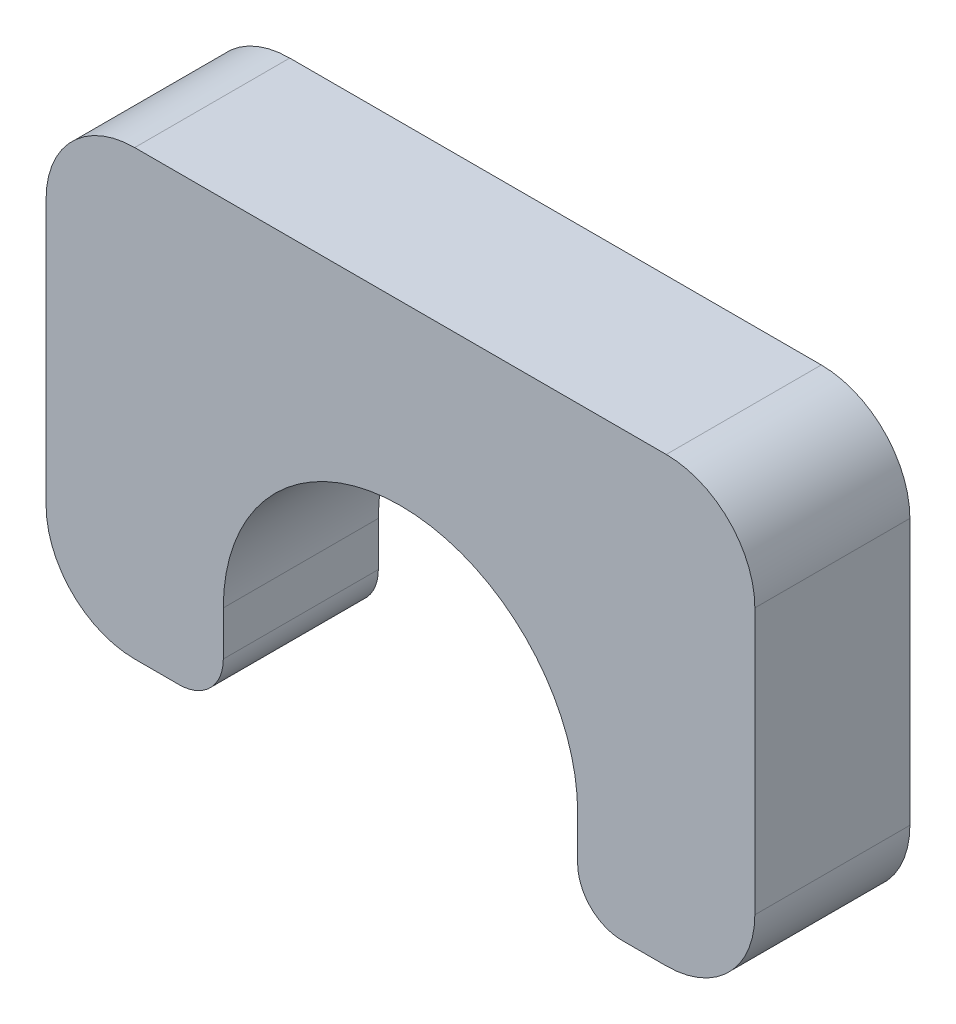
ISO-10303-21;
HEADER;
FILE_DESCRIPTION(('STEP AP214'),'2;1');
FILE_NAME('part.step','',(''),(''),'','','');
FILE_SCHEMA(('AUTOMOTIVE_DESIGN { 1 0 10303 214 1 1 1 1 }'));
ENDSEC;
DATA;
#1=APPLICATION_CONTEXT('core data for automotive mechanical design processes');
#2=APPLICATION_PROTOCOL_DEFINITION('international standard','automotive_design',2000,#1);
#3=PRODUCT_CONTEXT('',#1,'mechanical');
#4=PRODUCT('Part','Part','',(#3));
#5=PRODUCT_RELATED_PRODUCT_CATEGORY('part','',(#4));
#6=PRODUCT_DEFINITION_FORMATION('','',#4);
#7=PRODUCT_DEFINITION_CONTEXT('part definition',#1,'design');
#8=PRODUCT_DEFINITION('design','',#6,#7);
#9=PRODUCT_DEFINITION_SHAPE('','',#8);
#10=(LENGTH_UNIT() NAMED_UNIT(*) SI_UNIT(.MILLI.,.METRE.));
#11=(NAMED_UNIT(*) PLANE_ANGLE_UNIT() SI_UNIT($,.RADIAN.));
#12=(NAMED_UNIT(*) SI_UNIT($,.STERADIAN.) SOLID_ANGLE_UNIT());
#13=UNCERTAINTY_MEASURE_WITH_UNIT(LENGTH_MEASURE(1.E-05),#10,'distance_accuracy_value','');
#14=(GEOMETRIC_REPRESENTATION_CONTEXT(3) GLOBAL_UNCERTAINTY_ASSIGNED_CONTEXT((#13)) GLOBAL_UNIT_ASSIGNED_CONTEXT((#10,
#11,#12)) REPRESENTATION_CONTEXT('',''));
#15=CARTESIAN_POINT('',(0.,0.,0.));
#16=DIRECTION('',(0.,0.,1.));
#17=DIRECTION('',(1.,0.,0.));
#18=AXIS2_PLACEMENT_3D('',#15,#16,#17);
#19=CARTESIAN_POINT('',(-4.,0.,3.5));
#20=DIRECTION('',(-1.,0.,0.));
#21=DIRECTION('',(0.,0.,1.));
#22=AXIS2_PLACEMENT_3D('',#19,#20,#21);
#23=PLANE('',#22);
#24=DIRECTION('',(0.,1.,0.));
#25=VECTOR('',#24,1.);
#26=CARTESIAN_POINT('',(-4.,0.,3.5));
#27=LINE('',#26,#25);
#28=CARTESIAN_POINT('',(-4.,-4.,3.5));
#29=VERTEX_POINT('',#28);
#30=CARTESIAN_POINT('',(-4.,-3.,3.5));
#31=VERTEX_POINT('',#30);
#32=EDGE_CURVE('E141',#29,#31,#27,.T.);
#33=ORIENTED_EDGE('',*,*,#32,.F.);
#34=DIRECTION('',(0.,0.,-1.));
#35=VECTOR('',#34,1.);
#36=CARTESIAN_POINT('',(-4.,-4.,3.5));
#37=LINE('',#36,#35);
#38=CARTESIAN_POINT('',(-4.,-4.,0.));
#39=VERTEX_POINT('',#38);
#40=EDGE_CURVE('E50',#29,#39,#37,.T.);
#41=ORIENTED_EDGE('',*,*,#40,.T.);
#42=DIRECTION('',(0.,1.,0.));
#43=VECTOR('',#42,1.);
#44=CARTESIAN_POINT('',(-4.,0.,0.));
#45=LINE('',#44,#43);
#46=CARTESIAN_POINT('',(-4.,-3.,0.));
#47=VERTEX_POINT('',#46);
#48=EDGE_CURVE('E165',#39,#47,#45,.T.);
#49=ORIENTED_EDGE('',*,*,#48,.T.);
#50=DIRECTION('',(0.,0.,-1.));
#51=VECTOR('',#50,1.);
#52=CARTESIAN_POINT('',(-4.,-3.,3.5));
#53=LINE('',#52,#51);
#54=EDGE_CURVE('E158',#31,#47,#53,.T.);
#55=ORIENTED_EDGE('',*,*,#54,.F.);
#56=EDGE_LOOP('',(#33,#41,#49,#55));
#57=FACE_BOUND('',#56,.T.);
#58=ADVANCED_FACE('F41',(#57),#23,.F.);
#59=CARTESIAN_POINT('',(0.,-3.,3.5));
#60=DIRECTION('',(0.,0.,-1.));
#61=DIRECTION('',(-1.,0.,0.));
#62=AXIS2_PLACEMENT_3D('',#59,#60,#61);
#63=CYLINDRICAL_SURFACE('',#62,4.);
#64=CARTESIAN_POINT('',(0.,-3.,0.));
#65=DIRECTION('',(0.,0.,1.));
#66=DIRECTION('',(1.,0.,0.));
#67=AXIS2_PLACEMENT_3D('',#64,#65,#66);
#68=CIRCLE('',#67,4.);
#69=CARTESIAN_POINT('',(4.,-3.,0.));
#70=VERTEX_POINT('',#69);
#71=EDGE_CURVE('E197',#47,#70,#68,.F.);
#72=ORIENTED_EDGE('',*,*,#71,.T.);
#73=DIRECTION('',(0.,0.,-1.));
#74=VECTOR('',#73,1.);
#75=CARTESIAN_POINT('',(4.,-3.,3.5));
#76=LINE('',#75,#74);
#77=CARTESIAN_POINT('',(4.,-3.,3.5));
#78=VERTEX_POINT('',#77);
#79=EDGE_CURVE('E160',#78,#70,#76,.T.);
#80=ORIENTED_EDGE('',*,*,#79,.F.);
#81=CARTESIAN_POINT('',(0.,-3.,3.5));
#82=DIRECTION('',(0.,0.,1.));
#83=DIRECTION('',(1.,0.,0.));
#84=AXIS2_PLACEMENT_3D('',#81,#82,#83);
#85=CIRCLE('',#84,4.);
#86=EDGE_CURVE('E145',#31,#78,#85,.F.);
#87=ORIENTED_EDGE('',*,*,#86,.F.);
#88=ORIENTED_EDGE('',*,*,#54,.T.);
#89=EDGE_LOOP('',(#72,#80,#87,#88));
#90=FACE_BOUND('',#89,.T.);
#91=ADVANCED_FACE('F157',(#90),#63,.F.);
#92=CARTESIAN_POINT('',(4.,0.,3.5));
#93=DIRECTION('',(-1.,0.,0.));
#94=DIRECTION('',(0.,0.,1.));
#95=AXIS2_PLACEMENT_3D('',#92,#93,#94);
#96=PLANE('',#95);
#97=DIRECTION('',(0.,1.,0.));
#98=VECTOR('',#97,1.);
#99=CARTESIAN_POINT('',(4.,0.,0.));
#100=LINE('',#99,#98);
#101=CARTESIAN_POINT('',(4.,-4.,0.));
#102=VERTEX_POINT('',#101);
#103=EDGE_CURVE('E201',#102,#70,#100,.T.);
#104=ORIENTED_EDGE('',*,*,#103,.F.);
#105=DIRECTION('',(0.,0.,-1.));
#106=VECTOR('',#105,1.);
#107=CARTESIAN_POINT('',(4.,-4.,3.5));
#108=LINE('',#107,#106);
#109=CARTESIAN_POINT('',(4.,-4.,3.5));
#110=VERTEX_POINT('',#109);
#111=EDGE_CURVE('E184',#102,#110,#108,.F.);
#112=ORIENTED_EDGE('',*,*,#111,.T.);
#113=DIRECTION('',(0.,1.,0.));
#114=VECTOR('',#113,1.);
#115=CARTESIAN_POINT('',(4.,0.,3.5));
#116=LINE('',#115,#114);
#117=EDGE_CURVE('E162',#110,#78,#116,.T.);
#118=ORIENTED_EDGE('',*,*,#117,.T.);
#119=ORIENTED_EDGE('',*,*,#79,.T.);
#120=EDGE_LOOP('',(#104,#112,#118,#119));
#121=FACE_BOUND('',#120,.T.);
#122=ADVANCED_FACE('F313',(#121),#96,.T.);
#123=CARTESIAN_POINT('',(0.,-5.,3.5));
#124=DIRECTION('',(0.,1.,0.));
#125=DIRECTION('',(0.,0.,1.));
#126=AXIS2_PLACEMENT_3D('',#123,#124,#125);
#127=PLANE('',#126);
#128=DIRECTION('',(1.,0.,0.));
#129=VECTOR('',#128,1.);
#130=CARTESIAN_POINT('',(0.,-5.,3.5));
#131=LINE('',#130,#129);
#132=CARTESIAN_POINT('',(5.,-5.,3.5));
#133=VERTEX_POINT('',#132);
#134=CARTESIAN_POINT('',(6.,-5.,3.5));
#135=VERTEX_POINT('',#134);
#136=EDGE_CURVE('E288',#133,#135,#131,.T.);
#137=ORIENTED_EDGE('',*,*,#136,.F.);
#138=DIRECTION('',(0.,0.,-1.));
#139=VECTOR('',#138,1.);
#140=CARTESIAN_POINT('',(5.,-5.,0.));
#141=LINE('',#140,#139);
#142=CARTESIAN_POINT('',(5.,-5.,0.));
#143=VERTEX_POINT('',#142);
#144=EDGE_CURVE('E168',#133,#143,#141,.T.);
#145=ORIENTED_EDGE('',*,*,#144,.T.);
#146=DIRECTION('',(1.,0.,0.));
#147=VECTOR('',#146,1.);
#148=CARTESIAN_POINT('',(0.,-5.,0.));
#149=LINE('',#148,#147);
#150=CARTESIAN_POINT('',(6.,-5.,0.));
#151=VERTEX_POINT('',#150);
#152=EDGE_CURVE('E209',#143,#151,#149,.T.);
#153=ORIENTED_EDGE('',*,*,#152,.T.);
#154=DIRECTION('',(0.,0.,-1.));
#155=VECTOR('',#154,1.);
#156=CARTESIAN_POINT('',(6.,-5.,3.5));
#157=LINE('',#156,#155);
#158=EDGE_CURVE('E175',#135,#151,#157,.T.);
#159=ORIENTED_EDGE('',*,*,#158,.F.);
#160=EDGE_LOOP('',(#137,#145,#153,#159));
#161=FACE_BOUND('',#160,.T.);
#162=ADVANCED_FACE('F319',(#161),#127,.F.);
#163=CARTESIAN_POINT('',(6.,-3.,3.5));
#164=DIRECTION('',(0.,0.,-1.));
#165=DIRECTION('',(-1.,0.,0.));
#166=AXIS2_PLACEMENT_3D('',#163,#164,#165);
#167=CYLINDRICAL_SURFACE('',#166,2.);
#168=CARTESIAN_POINT('',(6.,-3.,0.));
#169=DIRECTION('',(0.,0.,1.));
#170=DIRECTION('',(1.,0.,0.));
#171=AXIS2_PLACEMENT_3D('',#168,#169,#170);
#172=CIRCLE('',#171,2.);
#173=CARTESIAN_POINT('',(8.,-3.,0.));
#174=VERTEX_POINT('',#173);
#175=EDGE_CURVE('E212',#151,#174,#172,.T.);
#176=ORIENTED_EDGE('',*,*,#175,.T.);
#177=DIRECTION('',(0.,0.,-1.));
#178=VECTOR('',#177,1.);
#179=CARTESIAN_POINT('',(8.,-3.,3.5));
#180=LINE('',#179,#178);
#181=CARTESIAN_POINT('',(8.,-3.,3.5));
#182=VERTEX_POINT('',#181);
#183=EDGE_CURVE('E258',#182,#174,#180,.T.);
#184=ORIENTED_EDGE('',*,*,#183,.F.);
#185=CARTESIAN_POINT('',(6.,-3.,3.5));
#186=DIRECTION('',(0.,0.,1.));
#187=DIRECTION('',(1.,0.,0.));
#188=AXIS2_PLACEMENT_3D('',#185,#186,#187);
#189=CIRCLE('',#188,2.);
#190=EDGE_CURVE('E269',#135,#182,#189,.T.);
#191=ORIENTED_EDGE('',*,*,#190,.F.);
#192=ORIENTED_EDGE('',*,*,#158,.T.);
#193=EDGE_LOOP('',(#176,#184,#191,#192));
#194=FACE_BOUND('',#193,.T.);
#195=ADVANCED_FACE('F267',(#194),#167,.T.);
#196=CARTESIAN_POINT('',(8.,0.,3.5));
#197=DIRECTION('',(-1.,0.,0.));
#198=DIRECTION('',(0.,0.,1.));
#199=AXIS2_PLACEMENT_3D('',#196,#197,#198);
#200=PLANE('',#199);
#201=DIRECTION('',(0.,1.,0.));
#202=VECTOR('',#201,1.);
#203=CARTESIAN_POINT('',(8.,0.,0.));
#204=LINE('',#203,#202);
#205=CARTESIAN_POINT('',(8.,3.,0.));
#206=VERTEX_POINT('',#205);
#207=EDGE_CURVE('E215',#174,#206,#204,.T.);
#208=ORIENTED_EDGE('',*,*,#207,.T.);
#209=DIRECTION('',(0.,0.,-1.));
#210=VECTOR('',#209,1.);
#211=CARTESIAN_POINT('',(8.,3.,3.5));
#212=LINE('',#211,#210);
#213=CARTESIAN_POINT('',(8.,3.,3.5));
#214=VERTEX_POINT('',#213);
#215=EDGE_CURVE('E255',#214,#206,#212,.T.);
#216=ORIENTED_EDGE('',*,*,#215,.F.);
#217=DIRECTION('',(0.,1.,0.));
#218=VECTOR('',#217,1.);
#219=CARTESIAN_POINT('',(8.,0.,3.5));
#220=LINE('',#219,#218);
#221=EDGE_CURVE('E279',#182,#214,#220,.T.);
#222=ORIENTED_EDGE('',*,*,#221,.F.);
#223=ORIENTED_EDGE('',*,*,#183,.T.);
#224=EDGE_LOOP('',(#208,#216,#222,#223));
#225=FACE_BOUND('',#224,.T.);
#226=ADVANCED_FACE('F276',(#225),#200,.F.);
#227=CARTESIAN_POINT('',(6.,3.,3.5));
#228=DIRECTION('',(0.,0.,-1.));
#229=DIRECTION('',(-1.,0.,0.));
#230=AXIS2_PLACEMENT_3D('',#227,#228,#229);
#231=CYLINDRICAL_SURFACE('',#230,2.);
#232=CARTESIAN_POINT('',(6.,3.,0.));
#233=DIRECTION('',(0.,0.,1.));
#234=DIRECTION('',(1.,0.,0.));
#235=AXIS2_PLACEMENT_3D('',#232,#233,#234);
#236=CIRCLE('',#235,2.);
#237=CARTESIAN_POINT('',(6.,5.,0.));
#238=VERTEX_POINT('',#237);
#239=EDGE_CURVE('E219',#238,#206,#236,.F.);
#240=ORIENTED_EDGE('',*,*,#239,.F.);
#241=DIRECTION('',(0.,0.,-1.));
#242=VECTOR('',#241,1.);
#243=CARTESIAN_POINT('',(6.,5.,3.5));
#244=LINE('',#243,#242);
#245=CARTESIAN_POINT('',(6.,5.,3.5));
#246=VERTEX_POINT('',#245);
#247=EDGE_CURVE('E252',#246,#238,#244,.T.);
#248=ORIENTED_EDGE('',*,*,#247,.F.);
#249=CARTESIAN_POINT('',(6.,3.,3.5));
#250=DIRECTION('',(0.,0.,1.));
#251=DIRECTION('',(1.,0.,0.));
#252=AXIS2_PLACEMENT_3D('',#249,#250,#251);
#253=CIRCLE('',#252,2.);
#254=EDGE_CURVE('E282',#246,#214,#253,.F.);
#255=ORIENTED_EDGE('',*,*,#254,.T.);
#256=ORIENTED_EDGE('',*,*,#215,.T.);
#257=EDGE_LOOP('',(#240,#248,#255,#256));
#258=FACE_BOUND('',#257,.T.);
#259=ADVANCED_FACE('F381',(#258),#231,.T.);
#260=CARTESIAN_POINT('',(0.,5.,3.5));
#261=DIRECTION('',(0.,1.,0.));
#262=DIRECTION('',(0.,0.,1.));
#263=AXIS2_PLACEMENT_3D('',#260,#261,#262);
#264=PLANE('',#263);
#265=DIRECTION('',(1.,0.,0.));
#266=VECTOR('',#265,1.);
#267=CARTESIAN_POINT('',(0.,5.,0.));
#268=LINE('',#267,#266);
#269=CARTESIAN_POINT('',(-6.,5.,0.));
#270=VERTEX_POINT('',#269);
#271=EDGE_CURVE('E223',#270,#238,#268,.T.);
#272=ORIENTED_EDGE('',*,*,#271,.F.);
#273=DIRECTION('',(0.,0.,-1.));
#274=VECTOR('',#273,1.);
#275=CARTESIAN_POINT('',(-6.,5.,3.5));
#276=LINE('',#275,#274);
#277=CARTESIAN_POINT('',(-6.,5.,3.5));
#278=VERTEX_POINT('',#277);
#279=EDGE_CURVE('E249',#278,#270,#276,.T.);
#280=ORIENTED_EDGE('',*,*,#279,.F.);
#281=DIRECTION('',(1.,0.,0.));
#282=VECTOR('',#281,1.);
#283=CARTESIAN_POINT('',(0.,5.,3.5));
#284=LINE('',#283,#282);
#285=EDGE_CURVE('E286',#278,#246,#284,.T.);
#286=ORIENTED_EDGE('',*,*,#285,.T.);
#287=ORIENTED_EDGE('',*,*,#247,.T.);
#288=EDGE_LOOP('',(#272,#280,#286,#287));
#289=FACE_BOUND('',#288,.T.);
#290=ADVANCED_FACE('F373',(#289),#264,.T.);
#291=CARTESIAN_POINT('',(-6.,3.,3.5));
#292=DIRECTION('',(0.,0.,-1.));
#293=DIRECTION('',(-1.,0.,0.));
#294=AXIS2_PLACEMENT_3D('',#291,#292,#293);
#295=CYLINDRICAL_SURFACE('',#294,2.);
#296=CARTESIAN_POINT('',(-6.,3.,0.));
#297=DIRECTION('',(0.,0.,1.));
#298=DIRECTION('',(1.,0.,0.));
#299=AXIS2_PLACEMENT_3D('',#296,#297,#298);
#300=CIRCLE('',#299,2.);
#301=CARTESIAN_POINT('',(-8.,3.,0.));
#302=VERTEX_POINT('',#301);
#303=EDGE_CURVE('E227',#302,#270,#300,.F.);
#304=ORIENTED_EDGE('',*,*,#303,.F.);
#305=DIRECTION('',(0.,0.,-1.));
#306=VECTOR('',#305,1.);
#307=CARTESIAN_POINT('',(-8.,3.,3.5));
#308=LINE('',#307,#306);
#309=CARTESIAN_POINT('',(-8.,3.,3.5));
#310=VERTEX_POINT('',#309);
#311=EDGE_CURVE('E246',#310,#302,#308,.T.);
#312=ORIENTED_EDGE('',*,*,#311,.F.);
#313=CARTESIAN_POINT('',(-6.,3.,3.5));
#314=DIRECTION('',(0.,0.,1.));
#315=DIRECTION('',(1.,0.,0.));
#316=AXIS2_PLACEMENT_3D('',#313,#314,#315);
#317=CIRCLE('',#316,2.);
#318=EDGE_CURVE('E295',#310,#278,#317,.F.);
#319=ORIENTED_EDGE('',*,*,#318,.T.);
#320=ORIENTED_EDGE('',*,*,#279,.T.);
#321=EDGE_LOOP('',(#304,#312,#319,#320));
#322=FACE_BOUND('',#321,.T.);
#323=ADVANCED_FACE('F366',(#322),#295,.T.);
#324=CARTESIAN_POINT('',(-8.,0.,3.5));
#325=DIRECTION('',(-1.,0.,0.));
#326=DIRECTION('',(0.,0.,1.));
#327=AXIS2_PLACEMENT_3D('',#324,#325,#326);
#328=PLANE('',#327);
#329=DIRECTION('',(0.,1.,0.));
#330=VECTOR('',#329,1.);
#331=CARTESIAN_POINT('',(-8.,0.,0.));
#332=LINE('',#331,#330);
#333=CARTESIAN_POINT('',(-8.,-3.,0.));
#334=VERTEX_POINT('',#333);
#335=EDGE_CURVE('E231',#334,#302,#332,.T.);
#336=ORIENTED_EDGE('',*,*,#335,.F.);
#337=DIRECTION('',(0.,0.,-1.));
#338=VECTOR('',#337,1.);
#339=CARTESIAN_POINT('',(-8.,-3.,3.5));
#340=LINE('',#339,#338);
#341=CARTESIAN_POINT('',(-8.,-3.,3.5));
#342=VERTEX_POINT('',#341);
#343=EDGE_CURVE('E242',#342,#334,#340,.T.);
#344=ORIENTED_EDGE('',*,*,#343,.F.);
#345=DIRECTION('',(0.,1.,0.));
#346=VECTOR('',#345,1.);
#347=CARTESIAN_POINT('',(-8.,0.,3.5));
#348=LINE('',#347,#346);
#349=EDGE_CURVE('E298',#342,#310,#348,.T.);
#350=ORIENTED_EDGE('',*,*,#349,.T.);
#351=ORIENTED_EDGE('',*,*,#311,.T.);
#352=EDGE_LOOP('',(#336,#344,#350,#351));
#353=FACE_BOUND('',#352,.T.);
#354=ADVANCED_FACE('F360',(#353),#328,.T.);
#355=CARTESIAN_POINT('',(-6.,-3.,3.5));
#356=DIRECTION('',(0.,0.,-1.));
#357=DIRECTION('',(-1.,0.,0.));
#358=AXIS2_PLACEMENT_3D('',#355,#356,#357);
#359=CYLINDRICAL_SURFACE('',#358,2.);
#360=CARTESIAN_POINT('',(-6.,-3.,0.));
#361=DIRECTION('',(0.,0.,1.));
#362=DIRECTION('',(1.,0.,0.));
#363=AXIS2_PLACEMENT_3D('',#360,#361,#362);
#364=CIRCLE('',#363,2.);
#365=CARTESIAN_POINT('',(-6.,-5.,0.));
#366=VERTEX_POINT('',#365);
#367=EDGE_CURVE('E235',#366,#334,#364,.F.);
#368=ORIENTED_EDGE('',*,*,#367,.F.);
#369=DIRECTION('',(0.,0.,-1.));
#370=VECTOR('',#369,1.);
#371=CARTESIAN_POINT('',(-6.,-5.,3.5));
#372=LINE('',#371,#370);
#373=CARTESIAN_POINT('',(-6.,-5.,3.5));
#374=VERTEX_POINT('',#373);
#375=EDGE_CURVE('E239',#374,#366,#372,.T.);
#376=ORIENTED_EDGE('',*,*,#375,.F.);
#377=CARTESIAN_POINT('',(-6.,-3.,3.5));
#378=DIRECTION('',(0.,0.,1.));
#379=DIRECTION('',(1.,0.,0.));
#380=AXIS2_PLACEMENT_3D('',#377,#378,#379);
#381=CIRCLE('',#380,2.);
#382=EDGE_CURVE('E204',#374,#342,#381,.F.);
#383=ORIENTED_EDGE('',*,*,#382,.T.);
#384=ORIENTED_EDGE('',*,*,#343,.T.);
#385=EDGE_LOOP('',(#368,#376,#383,#384));
#386=FACE_BOUND('',#385,.T.);
#387=ADVANCED_FACE('F332',(#386),#359,.T.);
#388=CARTESIAN_POINT('',(-5.,-5.,0.));
#389=VERTEX_POINT('',#388);
#390=EDGE_CURVE('E152',#366,#389,#149,.T.);
#391=ORIENTED_EDGE('',*,*,#390,.T.);
#392=DIRECTION('',(0.,0.,-1.));
#393=VECTOR('',#392,1.);
#394=CARTESIAN_POINT('',(-5.,-5.,3.5));
#395=LINE('',#394,#393);
#396=CARTESIAN_POINT('',(-5.,-5.,3.5));
#397=VERTEX_POINT('',#396);
#398=EDGE_CURVE('E11',#389,#397,#395,.F.);
#399=ORIENTED_EDGE('',*,*,#398,.T.);
#400=EDGE_CURVE('E243',#374,#397,#131,.T.);
#401=ORIENTED_EDGE('',*,*,#400,.F.);
#402=ORIENTED_EDGE('',*,*,#375,.T.);
#403=EDGE_LOOP('',(#391,#399,#401,#402));
#404=FACE_BOUND('',#403,.T.);
#405=ADVANCED_FACE('F322',(#404),#127,.F.);
#406=CARTESIAN_POINT('',(0.,0.,3.5));
#407=DIRECTION('',(0.,0.,1.));
#408=DIRECTION('',(1.,0.,0.));
#409=AXIS2_PLACEMENT_3D('',#406,#407,#408);
#410=PLANE('',#409);
#411=ORIENTED_EDGE('',*,*,#117,.F.);
#412=CARTESIAN_POINT('',(5.,-4.,3.5));
#413=DIRECTION('',(0.,0.,1.));
#414=DIRECTION('',(1.,0.,0.));
#415=AXIS2_PLACEMENT_3D('',#412,#413,#414);
#416=CIRCLE('',#415,1.);
#417=EDGE_CURVE('E189',#110,#133,#416,.T.);
#418=ORIENTED_EDGE('',*,*,#417,.T.);
#419=ORIENTED_EDGE('',*,*,#136,.T.);
#420=ORIENTED_EDGE('',*,*,#190,.T.);
#421=ORIENTED_EDGE('',*,*,#221,.T.);
#422=ORIENTED_EDGE('',*,*,#254,.F.);
#423=ORIENTED_EDGE('',*,*,#285,.F.);
#424=ORIENTED_EDGE('',*,*,#318,.F.);
#425=ORIENTED_EDGE('',*,*,#349,.F.);
#426=ORIENTED_EDGE('',*,*,#382,.F.);
#427=ORIENTED_EDGE('',*,*,#400,.T.);
#428=CARTESIAN_POINT('',(-5.,-4.,3.5));
#429=DIRECTION('',(0.,0.,1.));
#430=DIRECTION('',(1.,0.,0.));
#431=AXIS2_PLACEMENT_3D('',#428,#429,#430);
#432=CIRCLE('',#431,1.);
#433=EDGE_CURVE('E62',#397,#29,#432,.T.);
#434=ORIENTED_EDGE('',*,*,#433,.T.);
#435=ORIENTED_EDGE('',*,*,#32,.T.);
#436=ORIENTED_EDGE('',*,*,#86,.T.);
#437=EDGE_LOOP('',(#411,#418,#419,#420,#421,#422,#423,#424,#425,#426,#427,#434,#435,#436));
#438=FACE_BOUND('',#437,.T.);
#439=ADVANCED_FACE('F144',(#438),#410,.T.);
#440=CARTESIAN_POINT('',(0.,0.,0.));
#441=DIRECTION('',(0.,0.,1.));
#442=DIRECTION('',(1.,0.,0.));
#443=AXIS2_PLACEMENT_3D('',#440,#441,#442);
#444=PLANE('',#443);
#445=ORIENTED_EDGE('',*,*,#152,.F.);
#446=CARTESIAN_POINT('',(5.,-4.,0.));
#447=DIRECTION('',(0.,0.,1.));
#448=DIRECTION('',(1.,0.,0.));
#449=AXIS2_PLACEMENT_3D('',#446,#447,#448);
#450=CIRCLE('',#449,1.);
#451=EDGE_CURVE('E181',#143,#102,#450,.F.);
#452=ORIENTED_EDGE('',*,*,#451,.T.);
#453=ORIENTED_EDGE('',*,*,#103,.T.);
#454=ORIENTED_EDGE('',*,*,#71,.F.);
#455=ORIENTED_EDGE('',*,*,#48,.F.);
#456=CARTESIAN_POINT('',(-5.,-4.,0.));
#457=DIRECTION('',(0.,0.,1.));
#458=DIRECTION('',(1.,0.,0.));
#459=AXIS2_PLACEMENT_3D('',#456,#457,#458);
#460=CIRCLE('',#459,1.);
#461=EDGE_CURVE('E173',#39,#389,#460,.F.);
#462=ORIENTED_EDGE('',*,*,#461,.T.);
#463=ORIENTED_EDGE('',*,*,#390,.F.);
#464=ORIENTED_EDGE('',*,*,#367,.T.);
#465=ORIENTED_EDGE('',*,*,#335,.T.);
#466=ORIENTED_EDGE('',*,*,#303,.T.);
#467=ORIENTED_EDGE('',*,*,#271,.T.);
#468=ORIENTED_EDGE('',*,*,#239,.T.);
#469=ORIENTED_EDGE('',*,*,#207,.F.);
#470=ORIENTED_EDGE('',*,*,#175,.F.);
#471=EDGE_LOOP('',(#445,#452,#453,#454,#455,#462,#463,#464,#465,#466,#467,#468,#469,#470));
#472=FACE_BOUND('',#471,.T.);
#473=ADVANCED_FACE('F195',(#472),#444,.F.);
#474=CARTESIAN_POINT('',(5.,-4.,3.5));
#475=DIRECTION('',(0.,0.,1.));
#476=DIRECTION('',(1.,0.,0.));
#477=AXIS2_PLACEMENT_3D('',#474,#475,#476);
#478=CYLINDRICAL_SURFACE('',#477,1.);
#479=ORIENTED_EDGE('',*,*,#417,.F.);
#480=ORIENTED_EDGE('',*,*,#111,.F.);
#481=ORIENTED_EDGE('',*,*,#451,.F.);
#482=ORIENTED_EDGE('',*,*,#144,.F.);
#483=EDGE_LOOP('',(#479,#480,#481,#482));
#484=FACE_BOUND('',#483,.T.);
#485=ADVANCED_FACE('F318',(#484),#478,.T.);
#486=CARTESIAN_POINT('',(-5.,-4.,3.5));
#487=DIRECTION('',(0.,0.,-1.));
#488=DIRECTION('',(-1.,0.,0.));
#489=AXIS2_PLACEMENT_3D('',#486,#487,#488);
#490=CYLINDRICAL_SURFACE('',#489,1.);
#491=ORIENTED_EDGE('',*,*,#433,.F.);
#492=ORIENTED_EDGE('',*,*,#398,.F.);
#493=ORIENTED_EDGE('',*,*,#461,.F.);
#494=ORIENTED_EDGE('',*,*,#40,.F.);
#495=EDGE_LOOP('',(#491,#492,#493,#494));
#496=FACE_BOUND('',#495,.T.);
#497=ADVANCED_FACE('F43',(#496),#490,.T.);
#498=CLOSED_SHELL('',(#58,#91,#122,#162,#195,#226,#259,#290,#323,#354,#387,#405,#439,#473,#485,#497));
#499=MANIFOLD_SOLID_BREP('B2',#498);
#500=ADVANCED_BREP_SHAPE_REPRESENTATION('',(#18,#499),#14);
#501=SHAPE_DEFINITION_REPRESENTATION(#9,#500);
ENDSEC;
END-ISO-10303-21;
